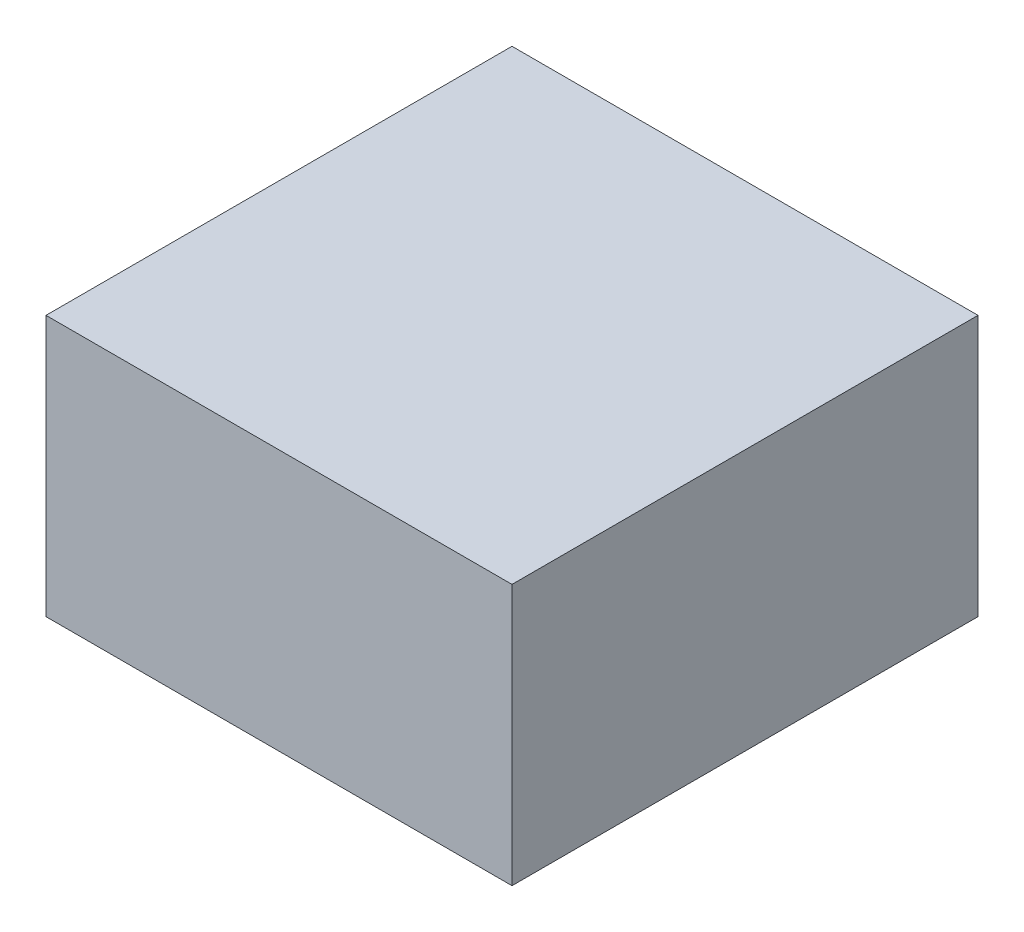
ISO-10303-21;
HEADER;
FILE_DESCRIPTION(('STEP AP214'),'2;1');
FILE_NAME('part.step','',(''),(''),'','','');
FILE_SCHEMA(('AUTOMOTIVE_DESIGN { 1 0 10303 214 1 1 1 1 }'));
ENDSEC;
DATA;
#1=APPLICATION_CONTEXT('core data for automotive mechanical design processes');
#2=APPLICATION_PROTOCOL_DEFINITION('international standard','automotive_design',2000,#1);
#3=PRODUCT_CONTEXT('',#1,'mechanical');
#4=PRODUCT('Part','Part','',(#3));
#5=PRODUCT_RELATED_PRODUCT_CATEGORY('part','',(#4));
#6=PRODUCT_DEFINITION_FORMATION('','',#4);
#7=PRODUCT_DEFINITION_CONTEXT('part definition',#1,'design');
#8=PRODUCT_DEFINITION('design','',#6,#7);
#9=PRODUCT_DEFINITION_SHAPE('','',#8);
#10=(LENGTH_UNIT() NAMED_UNIT(*) SI_UNIT(.MILLI.,.METRE.));
#11=(NAMED_UNIT(*) PLANE_ANGLE_UNIT() SI_UNIT($,.RADIAN.));
#12=(NAMED_UNIT(*) SI_UNIT($,.STERADIAN.) SOLID_ANGLE_UNIT());
#13=UNCERTAINTY_MEASURE_WITH_UNIT(LENGTH_MEASURE(1.E-05),#10,'distance_accuracy_value','');
#14=(GEOMETRIC_REPRESENTATION_CONTEXT(3) GLOBAL_UNCERTAINTY_ASSIGNED_CONTEXT((#13)) GLOBAL_UNIT_ASSIGNED_CONTEXT((#10,
#11,#12)) REPRESENTATION_CONTEXT('',''));
#15=CARTESIAN_POINT('',(0.,0.,0.));
#16=DIRECTION('',(0.,0.,1.));
#17=DIRECTION('',(1.,0.,0.));
#18=AXIS2_PLACEMENT_3D('',#15,#16,#17);
#19=CARTESIAN_POINT('',(0.,0.14,0.));
#20=DIRECTION('',(0.,1.,0.));
#21=DIRECTION('',(1.,0.,0.));
#22=AXIS2_PLACEMENT_3D('',#19,#20,#21);
#23=PLANE('',#22);
#24=DIRECTION('',(1.,0.,0.));
#25=VECTOR('',#24,1.);
#26=CARTESIAN_POINT('',(-0.125,0.14,0.25));
#27=LINE('',#26,#25);
#28=CARTESIAN_POINT('',(-0.125,0.14,0.25));
#29=VERTEX_POINT('',#28);
#30=CARTESIAN_POINT('',(0.125,0.14,0.25));
#31=VERTEX_POINT('',#30);
#32=EDGE_CURVE('E11',#29,#31,#27,.T.);
#33=ORIENTED_EDGE('',*,*,#32,.T.);
#34=DIRECTION('',(0.,0.,-1.));
#35=VECTOR('',#34,1.);
#36=CARTESIAN_POINT('',(0.125,0.14,0.25));
#37=LINE('',#36,#35);
#38=CARTESIAN_POINT('',(0.125,0.14,0.));
#39=VERTEX_POINT('',#38);
#40=EDGE_CURVE('E45',#31,#39,#37,.T.);
#41=ORIENTED_EDGE('',*,*,#40,.T.);
#42=DIRECTION('',(-1.,0.,0.));
#43=VECTOR('',#42,1.);
#44=CARTESIAN_POINT('',(0.125,0.14,0.));
#45=LINE('',#44,#43);
#46=CARTESIAN_POINT('',(-0.125,0.14,0.));
#47=VERTEX_POINT('',#46);
#48=EDGE_CURVE('E72',#39,#47,#45,.T.);
#49=ORIENTED_EDGE('',*,*,#48,.T.);
#50=DIRECTION('',(0.,0.,1.));
#51=VECTOR('',#50,1.);
#52=CARTESIAN_POINT('',(-0.125,0.14,0.));
#53=LINE('',#52,#51);
#54=EDGE_CURVE('E70',#47,#29,#53,.T.);
#55=ORIENTED_EDGE('',*,*,#54,.T.);
#56=EDGE_LOOP('',(#33,#41,#49,#55));
#57=FACE_BOUND('',#56,.T.);
#58=ADVANCED_FACE('F17',(#57),#23,.T.);
#59=CARTESIAN_POINT('',(-0.125,0.,0.25));
#60=DIRECTION('',(0.,0.,1.));
#61=DIRECTION('',(1.,0.,0.));
#62=AXIS2_PLACEMENT_3D('',#59,#60,#61);
#63=PLANE('',#62);
#64=DIRECTION('',(0.,1.,0.));
#65=VECTOR('',#64,1.);
#66=CARTESIAN_POINT('',(0.125,0.,0.25));
#67=LINE('',#66,#65);
#68=CARTESIAN_POINT('',(0.125,0.,0.25));
#69=VERTEX_POINT('',#68);
#70=EDGE_CURVE('E25',#69,#31,#67,.T.);
#71=ORIENTED_EDGE('',*,*,#70,.T.);
#72=ORIENTED_EDGE('',*,*,#32,.F.);
#73=DIRECTION('',(0.,1.,0.));
#74=VECTOR('',#73,1.);
#75=CARTESIAN_POINT('',(-0.125,0.,0.25));
#76=LINE('',#75,#74);
#77=CARTESIAN_POINT('',(-0.125,0.,0.25));
#78=VERTEX_POINT('',#77);
#79=EDGE_CURVE('E66',#78,#29,#76,.T.);
#80=ORIENTED_EDGE('',*,*,#79,.F.);
#81=DIRECTION('',(1.,0.,0.));
#82=VECTOR('',#81,1.);
#83=CARTESIAN_POINT('',(-0.125,0.,0.25));
#84=LINE('',#83,#82);
#85=EDGE_CURVE('E88',#78,#69,#84,.T.);
#86=ORIENTED_EDGE('',*,*,#85,.T.);
#87=EDGE_LOOP('',(#71,#72,#80,#86));
#88=FACE_BOUND('',#87,.T.);
#89=ADVANCED_FACE('F63',(#88),#63,.T.);
#90=CARTESIAN_POINT('',(0.125,0.,0.25));
#91=DIRECTION('',(1.,0.,0.));
#92=DIRECTION('',(0.,1.,0.));
#93=AXIS2_PLACEMENT_3D('',#90,#91,#92);
#94=PLANE('',#93);
#95=DIRECTION('',(0.,1.,0.));
#96=VECTOR('',#95,1.);
#97=CARTESIAN_POINT('',(0.125,0.,0.));
#98=LINE('',#97,#96);
#99=CARTESIAN_POINT('',(0.125,0.,0.));
#100=VERTEX_POINT('',#99);
#101=EDGE_CURVE('E94',#100,#39,#98,.T.);
#102=ORIENTED_EDGE('',*,*,#101,.T.);
#103=ORIENTED_EDGE('',*,*,#40,.F.);
#104=ORIENTED_EDGE('',*,*,#70,.F.);
#105=DIRECTION('',(0.,0.,-1.));
#106=VECTOR('',#105,1.);
#107=CARTESIAN_POINT('',(0.125,0.,0.25));
#108=LINE('',#107,#106);
#109=EDGE_CURVE('E132',#69,#100,#108,.T.);
#110=ORIENTED_EDGE('',*,*,#109,.T.);
#111=EDGE_LOOP('',(#102,#103,#104,#110));
#112=FACE_BOUND('',#111,.T.);
#113=ADVANCED_FACE('F165',(#112),#94,.T.);
#114=CARTESIAN_POINT('',(0.125,0.,0.));
#115=DIRECTION('',(0.,0.,-1.));
#116=DIRECTION('',(0.,-1.,0.));
#117=AXIS2_PLACEMENT_3D('',#114,#115,#116);
#118=PLANE('',#117);
#119=DIRECTION('',(0.,1.,0.));
#120=VECTOR('',#119,1.);
#121=CARTESIAN_POINT('',(-0.125,0.,0.));
#122=LINE('',#121,#120);
#123=CARTESIAN_POINT('',(-0.125,0.,0.));
#124=VERTEX_POINT('',#123);
#125=EDGE_CURVE('E76',#124,#47,#122,.T.);
#126=ORIENTED_EDGE('',*,*,#125,.T.);
#127=ORIENTED_EDGE('',*,*,#48,.F.);
#128=ORIENTED_EDGE('',*,*,#101,.F.);
#129=DIRECTION('',(-1.,0.,0.));
#130=VECTOR('',#129,1.);
#131=CARTESIAN_POINT('',(0.125,0.,0.));
#132=LINE('',#131,#130);
#133=EDGE_CURVE('E139',#100,#124,#132,.T.);
#134=ORIENTED_EDGE('',*,*,#133,.T.);
#135=EDGE_LOOP('',(#126,#127,#128,#134));
#136=FACE_BOUND('',#135,.T.);
#137=ADVANCED_FACE('F150',(#136),#118,.T.);
#138=CARTESIAN_POINT('',(-0.125,0.,0.));
#139=DIRECTION('',(-1.,0.,0.));
#140=DIRECTION('',(0.,0.,1.));
#141=AXIS2_PLACEMENT_3D('',#138,#139,#140);
#142=PLANE('',#141);
#143=ORIENTED_EDGE('',*,*,#79,.T.);
#144=ORIENTED_EDGE('',*,*,#54,.F.);
#145=ORIENTED_EDGE('',*,*,#125,.F.);
#146=DIRECTION('',(0.,0.,1.));
#147=VECTOR('',#146,1.);
#148=CARTESIAN_POINT('',(-0.125,0.,0.));
#149=LINE('',#148,#147);
#150=EDGE_CURVE('E80',#124,#78,#149,.T.);
#151=ORIENTED_EDGE('',*,*,#150,.T.);
#152=EDGE_LOOP('',(#143,#144,#145,#151));
#153=FACE_BOUND('',#152,.T.);
#154=ADVANCED_FACE('F78',(#153),#142,.T.);
#155=CARTESIAN_POINT('',(0.,0.,0.));
#156=DIRECTION('',(0.,1.,0.));
#157=DIRECTION('',(1.,0.,0.));
#158=AXIS2_PLACEMENT_3D('',#155,#156,#157);
#159=PLANE('',#158);
#160=ORIENTED_EDGE('',*,*,#133,.F.);
#161=ORIENTED_EDGE('',*,*,#109,.F.);
#162=ORIENTED_EDGE('',*,*,#85,.F.);
#163=ORIENTED_EDGE('',*,*,#150,.F.);
#164=EDGE_LOOP('',(#160,#161,#162,#163));
#165=FACE_BOUND('',#164,.T.);
#166=ADVANCED_FACE('F153',(#165),#159,.F.);
#167=CLOSED_SHELL('',(#58,#89,#113,#137,#154,#166));
#168=MANIFOLD_SOLID_BREP('B1',#167);
#169=ADVANCED_BREP_SHAPE_REPRESENTATION('',(#18,#168),#14);
#170=SHAPE_DEFINITION_REPRESENTATION(#9,#169);
ENDSEC;
END-ISO-10303-21;
